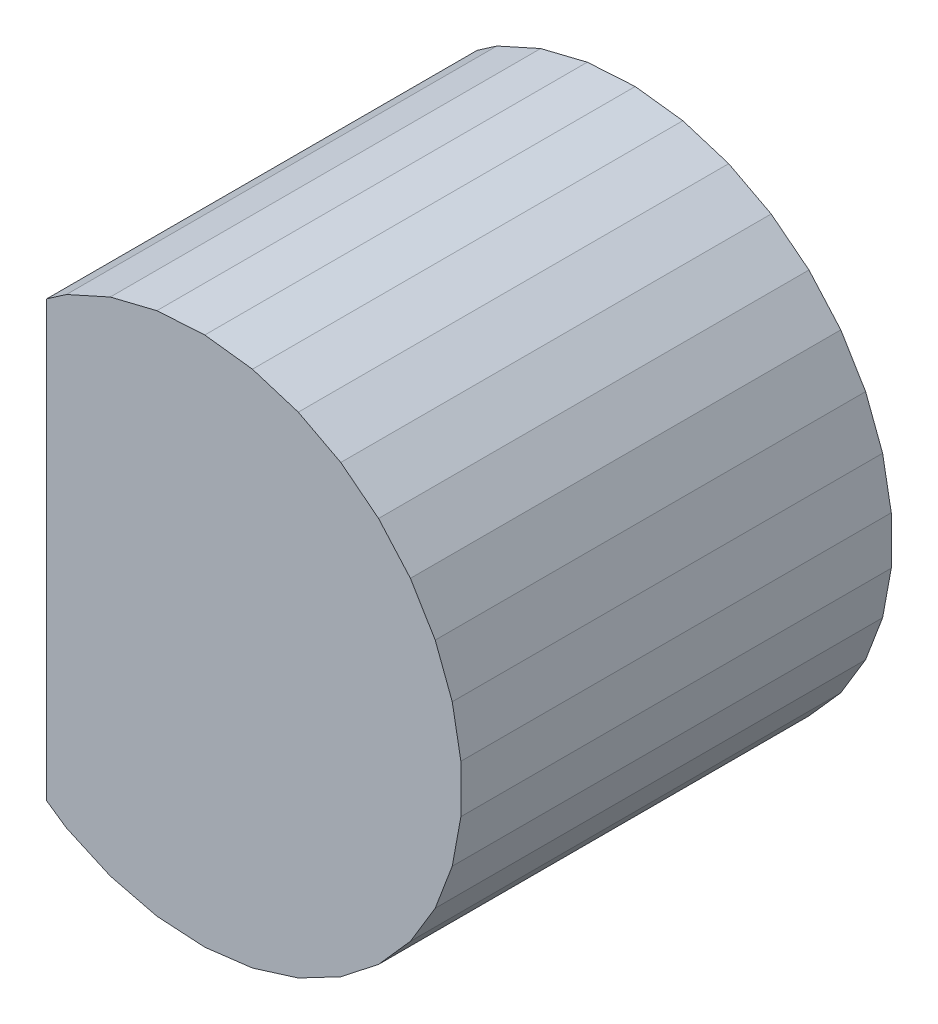
ISO-10303-21;
HEADER;
FILE_DESCRIPTION(('STEP AP214'),'2;1');
FILE_NAME('part.step','',(''),(''),'','','');
FILE_SCHEMA(('AUTOMOTIVE_DESIGN { 1 0 10303 214 1 1 1 1 }'));
ENDSEC;
DATA;
#1=APPLICATION_CONTEXT('core data for automotive mechanical design processes');
#2=APPLICATION_PROTOCOL_DEFINITION('international standard','automotive_design',2000,#1);
#3=PRODUCT_CONTEXT('',#1,'mechanical');
#4=PRODUCT('Part','Part','',(#3));
#5=PRODUCT_RELATED_PRODUCT_CATEGORY('part','',(#4));
#6=PRODUCT_DEFINITION_FORMATION('','',#4);
#7=PRODUCT_DEFINITION_CONTEXT('part definition',#1,'design');
#8=PRODUCT_DEFINITION('design','',#6,#7);
#9=PRODUCT_DEFINITION_SHAPE('','',#8);
#10=(LENGTH_UNIT() NAMED_UNIT(*) SI_UNIT(.MILLI.,.METRE.));
#11=(NAMED_UNIT(*) PLANE_ANGLE_UNIT() SI_UNIT($,.RADIAN.));
#12=(NAMED_UNIT(*) SI_UNIT($,.STERADIAN.) SOLID_ANGLE_UNIT());
#13=UNCERTAINTY_MEASURE_WITH_UNIT(LENGTH_MEASURE(1.E-05),#10,'distance_accuracy_value','');
#14=(GEOMETRIC_REPRESENTATION_CONTEXT(3) GLOBAL_UNCERTAINTY_ASSIGNED_CONTEXT((#13)) GLOBAL_UNIT_ASSIGNED_CONTEXT((#10,
#11,#12)) REPRESENTATION_CONTEXT('',''));
#15=CARTESIAN_POINT('',(0.,0.,0.));
#16=DIRECTION('',(0.,0.,1.));
#17=DIRECTION('',(1.,0.,0.));
#18=AXIS2_PLACEMENT_3D('',#15,#16,#17);
#19=CARTESIAN_POINT('',(-1.84258966,1.93467482,3.82999996));
#20=DIRECTION('',(0.,0.,1.));
#21=DIRECTION('',(1.,0.,0.));
#22=AXIS2_PLACEMENT_3D('',#19,#20,#21);
#23=PLANE('',#22);
#24=DIRECTION('',(0.823090677896412,0.567909971703284,0.));
#25=VECTOR('',#24,1.);
#26=CARTESIAN_POINT('',(-1.84258966,1.93467482,3.82999996));
#27=LINE('',#26,#25);
#28=CARTESIAN_POINT('',(-1.84258966,1.93467482,3.82999996));
#29=VERTEX_POINT('',#28);
#30=CARTESIAN_POINT('',(-1.66679626,2.05596744,3.82999996));
#31=VERTEX_POINT('',#30);
#32=EDGE_CURVE('E291',#29,#31,#27,.T.);
#33=ORIENTED_EDGE('',*,*,#32,.F.);
#34=DIRECTION('',(0.819231920643114,0.57346234418608,0.));
#35=VECTOR('',#34,1.);
#36=CARTESIAN_POINT('',(-1.84264046,1.93463672,3.82999996));
#37=LINE('',#36,#35);
#38=CARTESIAN_POINT('',(-1.84264046,1.93463672,3.82999996));
#39=VERTEX_POINT('',#38);
#40=EDGE_CURVE('E292',#39,#29,#37,.T.);
#41=ORIENTED_EDGE('',*,*,#40,.F.);
#42=DIRECTION('',(0.664363838732906,0.747409318769894,0.));
#43=VECTOR('',#42,1.);
#44=CARTESIAN_POINT('',(-1.84272174,1.93454528,3.82999996));
#45=LINE('',#44,#43);
#46=CARTESIAN_POINT('',(-1.84272174,1.93454528,3.82999996));
#47=VERTEX_POINT('',#46);
#48=EDGE_CURVE('E307',#47,#39,#45,.T.);
#49=ORIENTED_EDGE('',*,*,#48,.F.);
#50=DIRECTION('',(0.471652250398062,0.881784641902116,0.));
#51=VECTOR('',#50,1.);
#52=CARTESIAN_POINT('',(-1.84278016,1.93443606,3.82999996));
#53=LINE('',#52,#51);
#54=CARTESIAN_POINT('',(-1.84278016,1.93443606,3.82999996));
#55=VERTEX_POINT('',#54);
#56=EDGE_CURVE('E634',#55,#47,#53,.T.);
#57=ORIENTED_EDGE('',*,*,#56,.F.);
#58=DIRECTION('',(0.227884467340065,0.973688178805276,0.));
#59=VECTOR('',#58,1.);
#60=CARTESIAN_POINT('',(-1.8428081,1.93431668,3.82999996));
#61=LINE('',#60,#59);
#62=CARTESIAN_POINT('',(-1.8428081,1.93431668,3.82999996));
#63=VERTEX_POINT('',#62);
#64=EDGE_CURVE('E630',#63,#55,#61,.T.);
#65=ORIENTED_EDGE('',*,*,#64,.F.);
#66=DIRECTION('',(0.,1.,0.));
#67=VECTOR('',#66,1.);
#68=CARTESIAN_POINT('',(-1.8428081,-1.93466974,3.82999996));
#69=LINE('',#68,#67);
#70=CARTESIAN_POINT('',(-1.8428081,-1.93466974,3.82999996));
#71=VERTEX_POINT('',#70);
#72=EDGE_CURVE('E626',#71,#63,#69,.T.);
#73=ORIENTED_EDGE('',*,*,#72,.F.);
#74=DIRECTION('',(-1.,0.,0.));
#75=VECTOR('',#74,1.);
#76=CARTESIAN_POINT('',(-1.84258712,-1.93466974,3.82999996));
#77=LINE('',#76,#75);
#78=CARTESIAN_POINT('',(-1.84258712,-1.93466974,3.82999996));
#79=VERTEX_POINT('',#78);
#80=EDGE_CURVE('E622',#79,#71,#77,.T.);
#81=ORIENTED_EDGE('',*,*,#80,.F.);
#82=DIRECTION('',(-0.823090677896412,0.567909971703284,0.));
#83=VECTOR('',#82,1.);
#84=CARTESIAN_POINT('',(-1.66679626,-2.0559649,3.82999996));
#85=LINE('',#84,#83);
#86=CARTESIAN_POINT('',(-1.66679626,-2.0559649,3.82999996));
#87=VERTEX_POINT('',#86);
#88=EDGE_CURVE('E618',#87,#79,#85,.T.);
#89=ORIENTED_EDGE('',*,*,#88,.F.);
#90=DIRECTION('',(-0.911967561990754,0.410262313497889,0.));
#91=VECTOR('',#90,1.);
#92=CARTESIAN_POINT('',(-1.27724662,-2.23120966,3.82999996));
#93=LINE('',#92,#91);
#94=CARTESIAN_POINT('',(-1.27724662,-2.23120966,3.82999996));
#95=VERTEX_POINT('',#94);
#96=EDGE_CURVE('E614',#95,#87,#93,.T.);
#97=ORIENTED_EDGE('',*,*,#96,.F.);
#98=DIRECTION('',(-0.970978241994064,0.239167835576016,0.));
#99=VECTOR('',#98,1.);
#100=CARTESIAN_POINT('',(-0.86249002,-2.333371,3.82999996));
#101=LINE('',#100,#99);
#102=CARTESIAN_POINT('',(-0.86249002,-2.333371,3.82999996));
#103=VERTEX_POINT('',#102);
#104=EDGE_CURVE('E610',#103,#95,#101,.T.);
#105=ORIENTED_EDGE('',*,*,#104,.F.);
#106=DIRECTION('',(-0.998183795511517,0.0602420980562808,0.));
#107=VECTOR('',#106,1.);
#108=CARTESIAN_POINT('',(-0.43611038,-2.35910374,3.82999996));
#109=LINE('',#108,#107);
#110=CARTESIAN_POINT('',(-0.43611038,-2.35910374,3.82999996));
#111=VERTEX_POINT('',#110);
#112=EDGE_CURVE('E606',#111,#103,#109,.T.);
#113=ORIENTED_EDGE('',*,*,#112,.F.);
#114=DIRECTION('',(-0.992694229772383,-0.120657225961047,0.));
#115=VECTOR('',#114,1.);
#116=CARTESIAN_POINT('',(-0.0120777,-2.3075646,3.82999996));
#117=LINE('',#116,#115);
#118=CARTESIAN_POINT('',(-0.0120777,-2.3075646,3.82999996));
#119=VERTEX_POINT('',#118);
#120=EDGE_CURVE('E602',#119,#111,#117,.T.);
#121=ORIENTED_EDGE('',*,*,#120,.F.);
#122=DIRECTION('',(-0.954689978785622,-0.297602157932882,0.));
#123=VECTOR('',#122,1.);
#124=CARTESIAN_POINT('',(0.39572184,-2.18044268,3.82999996));
#125=LINE('',#124,#123);
#126=CARTESIAN_POINT('',(0.39572184,-2.18044268,3.82999996));
#127=VERTEX_POINT('',#126);
#128=EDGE_CURVE('E598',#127,#119,#125,.T.);
#129=ORIENTED_EDGE('',*,*,#128,.F.);
#130=DIRECTION('',(-0.885415094450529,-0.464801151589753,0.));
#131=VECTOR('',#130,1.);
#132=CARTESIAN_POINT('',(0.77393038,-1.98190104,3.82999996));
#133=LINE('',#132,#131);
#134=CARTESIAN_POINT('',(0.77393038,-1.98190104,3.82999996));
#135=VERTEX_POINT('',#134);
#136=EDGE_CURVE('E594',#135,#127,#133,.T.);
#137=ORIENTED_EDGE('',*,*,#136,.F.);
#138=DIRECTION('',(-0.787136200354727,-0.616779216649786,0.));
#139=VECTOR('',#138,1.);
#140=CARTESIAN_POINT('',(1.1101578,-1.71844208,3.82999996));
#141=LINE('',#140,#139);
#142=CARTESIAN_POINT('',(1.1101578,-1.71844208,3.82999996));
#143=VERTEX_POINT('',#142);
#144=EDGE_CURVE('E590',#143,#135,#141,.T.);
#145=ORIENTED_EDGE('',*,*,#144,.F.);
#146=DIRECTION('',(-0.663074755067046,-0.748553183944052,0.));
#147=VECTOR('',#146,1.);
#148=CARTESIAN_POINT('',(1.3933932,-1.39869418,3.82999996));
#149=LINE('',#148,#147);
#150=CARTESIAN_POINT('',(1.3933932,-1.39869418,3.82999996));
#151=VERTEX_POINT('',#150);
#152=EDGE_CURVE('E586',#151,#143,#149,.T.);
#153=ORIENTED_EDGE('',*,*,#152,.F.);
#154=DIRECTION('',(-0.517301766071713,-0.855803063104525,0.));
#155=VECTOR('',#154,1.);
#156=CARTESIAN_POINT('',(1.6143605,-1.03313484,3.82999996));
#157=LINE('',#156,#155);
#158=CARTESIAN_POINT('',(1.6143605,-1.03313484,3.82999996));
#159=VERTEX_POINT('',#158);
#160=EDGE_CURVE('E582',#159,#151,#157,.T.);
#161=ORIENTED_EDGE('',*,*,#160,.F.);
#162=DIRECTION('',(-0.354574822507846,-0.935027644106595,0.));
#163=VECTOR('',#162,1.);
#164=CARTESIAN_POINT('',(1.76581816,-0.63373508,3.82999996));
#165=LINE('',#164,#163);
#166=CARTESIAN_POINT('',(1.76581816,-0.63373508,3.82999996));
#167=VERTEX_POINT('',#166);
#168=EDGE_CURVE('E578',#167,#159,#165,.T.);
#169=ORIENTED_EDGE('',*,*,#168,.F.);
#170=DIRECTION('',(-0.180244738035957,-0.983621794395767,0.));
#171=VECTOR('',#170,1.);
#172=CARTESIAN_POINT('',(1.84281064,-0.2135759,3.82999996));
#173=LINE('',#172,#171);
#174=CARTESIAN_POINT('',(1.84281064,-0.2135759,3.82999996));
#175=VERTEX_POINT('',#174);
#176=EDGE_CURVE('E574',#175,#167,#173,.T.);
#177=ORIENTED_EDGE('',*,*,#176,.F.);
#178=DIRECTION('',(0.,-1.,0.));
#179=VECTOR('',#178,1.);
#180=CARTESIAN_POINT('',(1.84281064,0.21357844,3.82999996));
#181=LINE('',#180,#179);
#182=CARTESIAN_POINT('',(1.84281064,0.21357844,3.82999996));
#183=VERTEX_POINT('',#182);
#184=EDGE_CURVE('E570',#183,#175,#181,.T.);
#185=ORIENTED_EDGE('',*,*,#184,.F.);
#186=DIRECTION('',(0.180244738035957,-0.983621794395767,0.));
#187=VECTOR('',#186,1.);
#188=CARTESIAN_POINT('',(1.76581816,0.63373762,3.82999996));
#189=LINE('',#188,#187);
#190=CARTESIAN_POINT('',(1.76581816,0.63373762,3.82999996));
#191=VERTEX_POINT('',#190);
#192=EDGE_CURVE('E566',#191,#183,#189,.T.);
#193=ORIENTED_EDGE('',*,*,#192,.F.);
#194=DIRECTION('',(0.354574822507846,-0.935027644106595,0.));
#195=VECTOR('',#194,1.);
#196=CARTESIAN_POINT('',(1.6143605,1.03313738,3.82999996));
#197=LINE('',#196,#195);
#198=CARTESIAN_POINT('',(1.6143605,1.03313738,3.82999996));
#199=VERTEX_POINT('',#198);
#200=EDGE_CURVE('E562',#199,#191,#197,.T.);
#201=ORIENTED_EDGE('',*,*,#200,.F.);
#202=DIRECTION('',(0.517301766071713,-0.855803063104525,0.));
#203=VECTOR('',#202,1.);
#204=CARTESIAN_POINT('',(1.3933932,1.39869672,3.82999996));
#205=LINE('',#204,#203);
#206=CARTESIAN_POINT('',(1.3933932,1.39869672,3.82999996));
#207=VERTEX_POINT('',#206);
#208=EDGE_CURVE('E558',#207,#199,#205,.T.);
#209=ORIENTED_EDGE('',*,*,#208,.F.);
#210=DIRECTION('',(0.663074755067046,-0.748553183944052,0.));
#211=VECTOR('',#210,1.);
#212=CARTESIAN_POINT('',(1.1101578,1.71844462,3.82999996));
#213=LINE('',#212,#211);
#214=CARTESIAN_POINT('',(1.1101578,1.71844462,3.82999996));
#215=VERTEX_POINT('',#214);
#216=EDGE_CURVE('E554',#215,#207,#213,.T.);
#217=ORIENTED_EDGE('',*,*,#216,.F.);
#218=DIRECTION('',(0.787136200354727,-0.616779216649786,0.));
#219=VECTOR('',#218,1.);
#220=CARTESIAN_POINT('',(0.77393038,1.98190358,3.82999996));
#221=LINE('',#220,#219);
#222=CARTESIAN_POINT('',(0.77393038,1.98190358,3.82999996));
#223=VERTEX_POINT('',#222);
#224=EDGE_CURVE('E550',#223,#215,#221,.T.);
#225=ORIENTED_EDGE('',*,*,#224,.F.);
#226=DIRECTION('',(0.885415094450529,-0.464801151589753,0.));
#227=VECTOR('',#226,1.);
#228=CARTESIAN_POINT('',(0.39572184,2.18044522,3.82999996));
#229=LINE('',#228,#227);
#230=CARTESIAN_POINT('',(0.39572184,2.18044522,3.82999996));
#231=VERTEX_POINT('',#230);
#232=EDGE_CURVE('E546',#231,#223,#229,.T.);
#233=ORIENTED_EDGE('',*,*,#232,.F.);
#234=DIRECTION('',(0.954689978785622,-0.297602157932882,0.));
#235=VECTOR('',#234,1.);
#236=CARTESIAN_POINT('',(-0.0120777,2.30756714,3.82999996));
#237=LINE('',#236,#235);
#238=CARTESIAN_POINT('',(-0.0120777,2.30756714,3.82999996));
#239=VERTEX_POINT('',#238);
#240=EDGE_CURVE('E542',#239,#231,#237,.T.);
#241=ORIENTED_EDGE('',*,*,#240,.F.);
#242=DIRECTION('',(0.992694229772383,-0.120657225961047,0.));
#243=VECTOR('',#242,1.);
#244=CARTESIAN_POINT('',(-0.43611038,2.35910628,3.82999996));
#245=LINE('',#244,#243);
#246=CARTESIAN_POINT('',(-0.43611038,2.35910628,3.82999996));
#247=VERTEX_POINT('',#246);
#248=EDGE_CURVE('E538',#247,#239,#245,.T.);
#249=ORIENTED_EDGE('',*,*,#248,.F.);
#250=DIRECTION('',(0.998183795511515,0.0602420980563107,0.));
#251=VECTOR('',#250,1.);
#252=CARTESIAN_POINT('',(-0.86249002,2.33337354,3.82999996));
#253=LINE('',#252,#251);
#254=CARTESIAN_POINT('',(-0.86249002,2.33337354,3.82999996));
#255=VERTEX_POINT('',#254);
#256=EDGE_CURVE('E534',#255,#247,#253,.T.);
#257=ORIENTED_EDGE('',*,*,#256,.F.);
#258=DIRECTION('',(0.970978241994064,0.239167835576016,0.));
#259=VECTOR('',#258,1.);
#260=CARTESIAN_POINT('',(-1.27724662,2.2312122,3.82999996));
#261=LINE('',#260,#259);
#262=CARTESIAN_POINT('',(-1.27724662,2.2312122,3.82999996));
#263=VERTEX_POINT('',#262);
#264=EDGE_CURVE('E530',#263,#255,#261,.T.);
#265=ORIENTED_EDGE('',*,*,#264,.F.);
#266=DIRECTION('',(0.911967561990754,0.410262313497889,0.));
#267=VECTOR('',#266,1.);
#268=CARTESIAN_POINT('',(-1.66679626,2.05596744,3.82999996));
#269=LINE('',#268,#267);
#270=EDGE_CURVE('E295',#31,#263,#269,.T.);
#271=ORIENTED_EDGE('',*,*,#270,.F.);
#272=EDGE_LOOP('',(#33,#41,#49,#57,#65,#73,#81,#89,#97,#105,#113,#121,#129,#137,#145,#153,#161,
#169,#177,#185,#193,#201,#209,#217,#225,#233,#241,#249,#257,#265,#271));
#273=FACE_BOUND('',#272,.T.);
#274=ADVANCED_FACE('F17',(#273),#23,.T.);
#275=CARTESIAN_POINT('',(-1.84258966,1.93467482,0.));
#276=DIRECTION('',(0.,0.,1.));
#277=DIRECTION('',(1.,0.,0.));
#278=AXIS2_PLACEMENT_3D('',#275,#276,#277);
#279=PLANE('',#278);
#280=DIRECTION('',(0.823090677896412,0.567909971703284,0.));
#281=VECTOR('',#280,1.);
#282=CARTESIAN_POINT('',(-1.84258966,1.93467482,0.));
#283=LINE('',#282,#281);
#284=CARTESIAN_POINT('',(-1.84258966,1.93467482,0.));
#285=VERTEX_POINT('',#284);
#286=CARTESIAN_POINT('',(-1.66679626,2.05596744,0.));
#287=VERTEX_POINT('',#286);
#288=EDGE_CURVE('E310',#285,#287,#283,.T.);
#289=ORIENTED_EDGE('',*,*,#288,.T.);
#290=DIRECTION('',(0.911967561990754,0.410262313497889,0.));
#291=VECTOR('',#290,1.);
#292=CARTESIAN_POINT('',(-1.66679626,2.05596744,0.));
#293=LINE('',#292,#291);
#294=CARTESIAN_POINT('',(-1.27724662,2.2312122,0.));
#295=VERTEX_POINT('',#294);
#296=EDGE_CURVE('E523',#287,#295,#293,.T.);
#297=ORIENTED_EDGE('',*,*,#296,.T.);
#298=DIRECTION('',(0.970978241994064,0.239167835576016,0.));
#299=VECTOR('',#298,1.);
#300=CARTESIAN_POINT('',(-1.27724662,2.2312122,0.));
#301=LINE('',#300,#299);
#302=CARTESIAN_POINT('',(-0.86249002,2.33337354,0.));
#303=VERTEX_POINT('',#302);
#304=EDGE_CURVE('E520',#295,#303,#301,.T.);
#305=ORIENTED_EDGE('',*,*,#304,.T.);
#306=DIRECTION('',(0.998183795511515,0.0602420980563107,0.));
#307=VECTOR('',#306,1.);
#308=CARTESIAN_POINT('',(-0.86249002,2.33337354,0.));
#309=LINE('',#308,#307);
#310=CARTESIAN_POINT('',(-0.43611038,2.35910628,0.));
#311=VERTEX_POINT('',#310);
#312=EDGE_CURVE('E517',#303,#311,#309,.T.);
#313=ORIENTED_EDGE('',*,*,#312,.T.);
#314=DIRECTION('',(0.992694229772383,-0.120657225961047,0.));
#315=VECTOR('',#314,1.);
#316=CARTESIAN_POINT('',(-0.43611038,2.35910628,0.));
#317=LINE('',#316,#315);
#318=CARTESIAN_POINT('',(-0.0120777,2.30756714,0.));
#319=VERTEX_POINT('',#318);
#320=EDGE_CURVE('E514',#311,#319,#317,.T.);
#321=ORIENTED_EDGE('',*,*,#320,.T.);
#322=DIRECTION('',(0.954689978785622,-0.297602157932882,0.));
#323=VECTOR('',#322,1.);
#324=CARTESIAN_POINT('',(-0.0120777,2.30756714,0.));
#325=LINE('',#324,#323);
#326=CARTESIAN_POINT('',(0.39572184,2.18044522,0.));
#327=VERTEX_POINT('',#326);
#328=EDGE_CURVE('E511',#319,#327,#325,.T.);
#329=ORIENTED_EDGE('',*,*,#328,.T.);
#330=DIRECTION('',(0.885415094450529,-0.464801151589753,0.));
#331=VECTOR('',#330,1.);
#332=CARTESIAN_POINT('',(0.39572184,2.18044522,0.));
#333=LINE('',#332,#331);
#334=CARTESIAN_POINT('',(0.77393038,1.98190358,0.));
#335=VERTEX_POINT('',#334);
#336=EDGE_CURVE('E508',#327,#335,#333,.T.);
#337=ORIENTED_EDGE('',*,*,#336,.T.);
#338=DIRECTION('',(0.787136200354727,-0.616779216649786,0.));
#339=VECTOR('',#338,1.);
#340=CARTESIAN_POINT('',(0.77393038,1.98190358,0.));
#341=LINE('',#340,#339);
#342=CARTESIAN_POINT('',(1.1101578,1.71844462,0.));
#343=VERTEX_POINT('',#342);
#344=EDGE_CURVE('E505',#335,#343,#341,.T.);
#345=ORIENTED_EDGE('',*,*,#344,.T.);
#346=DIRECTION('',(0.663074755067046,-0.748553183944052,0.));
#347=VECTOR('',#346,1.);
#348=CARTESIAN_POINT('',(1.1101578,1.71844462,0.));
#349=LINE('',#348,#347);
#350=CARTESIAN_POINT('',(1.3933932,1.39869672,0.));
#351=VERTEX_POINT('',#350);
#352=EDGE_CURVE('E502',#343,#351,#349,.T.);
#353=ORIENTED_EDGE('',*,*,#352,.T.);
#354=DIRECTION('',(0.517301766071713,-0.855803063104525,0.));
#355=VECTOR('',#354,1.);
#356=CARTESIAN_POINT('',(1.3933932,1.39869672,0.));
#357=LINE('',#356,#355);
#358=CARTESIAN_POINT('',(1.6143605,1.03313738,0.));
#359=VERTEX_POINT('',#358);
#360=EDGE_CURVE('E499',#351,#359,#357,.T.);
#361=ORIENTED_EDGE('',*,*,#360,.T.);
#362=DIRECTION('',(0.354574822507846,-0.935027644106595,0.));
#363=VECTOR('',#362,1.);
#364=CARTESIAN_POINT('',(1.6143605,1.03313738,0.));
#365=LINE('',#364,#363);
#366=CARTESIAN_POINT('',(1.76581816,0.63373762,0.));
#367=VERTEX_POINT('',#366);
#368=EDGE_CURVE('E496',#359,#367,#365,.T.);
#369=ORIENTED_EDGE('',*,*,#368,.T.);
#370=DIRECTION('',(0.180244738035957,-0.983621794395767,0.));
#371=VECTOR('',#370,1.);
#372=CARTESIAN_POINT('',(1.76581816,0.63373762,0.));
#373=LINE('',#372,#371);
#374=CARTESIAN_POINT('',(1.84281064,0.21357844,0.));
#375=VERTEX_POINT('',#374);
#376=EDGE_CURVE('E493',#367,#375,#373,.T.);
#377=ORIENTED_EDGE('',*,*,#376,.T.);
#378=DIRECTION('',(0.,-1.,0.));
#379=VECTOR('',#378,1.);
#380=CARTESIAN_POINT('',(1.84281064,0.21357844,0.));
#381=LINE('',#380,#379);
#382=CARTESIAN_POINT('',(1.84281064,-0.2135759,0.));
#383=VERTEX_POINT('',#382);
#384=EDGE_CURVE('E490',#375,#383,#381,.T.);
#385=ORIENTED_EDGE('',*,*,#384,.T.);
#386=DIRECTION('',(-0.180244738035957,-0.983621794395767,0.));
#387=VECTOR('',#386,1.);
#388=CARTESIAN_POINT('',(1.84281064,-0.2135759,0.));
#389=LINE('',#388,#387);
#390=CARTESIAN_POINT('',(1.76581816,-0.63373508,0.));
#391=VERTEX_POINT('',#390);
#392=EDGE_CURVE('E487',#383,#391,#389,.T.);
#393=ORIENTED_EDGE('',*,*,#392,.T.);
#394=DIRECTION('',(-0.354574822507846,-0.935027644106595,0.));
#395=VECTOR('',#394,1.);
#396=CARTESIAN_POINT('',(1.76581816,-0.63373508,0.));
#397=LINE('',#396,#395);
#398=CARTESIAN_POINT('',(1.6143605,-1.03313484,0.));
#399=VERTEX_POINT('',#398);
#400=EDGE_CURVE('E484',#391,#399,#397,.T.);
#401=ORIENTED_EDGE('',*,*,#400,.T.);
#402=DIRECTION('',(-0.517301766071713,-0.855803063104525,0.));
#403=VECTOR('',#402,1.);
#404=CARTESIAN_POINT('',(1.6143605,-1.03313484,0.));
#405=LINE('',#404,#403);
#406=CARTESIAN_POINT('',(1.3933932,-1.39869418,0.));
#407=VERTEX_POINT('',#406);
#408=EDGE_CURVE('E481',#399,#407,#405,.T.);
#409=ORIENTED_EDGE('',*,*,#408,.T.);
#410=DIRECTION('',(-0.663074755067046,-0.748553183944052,0.));
#411=VECTOR('',#410,1.);
#412=CARTESIAN_POINT('',(1.3933932,-1.39869418,0.));
#413=LINE('',#412,#411);
#414=CARTESIAN_POINT('',(1.1101578,-1.71844208,0.));
#415=VERTEX_POINT('',#414);
#416=EDGE_CURVE('E478',#407,#415,#413,.T.);
#417=ORIENTED_EDGE('',*,*,#416,.T.);
#418=DIRECTION('',(-0.787136200354727,-0.616779216649786,0.));
#419=VECTOR('',#418,1.);
#420=CARTESIAN_POINT('',(1.1101578,-1.71844208,0.));
#421=LINE('',#420,#419);
#422=CARTESIAN_POINT('',(0.77393038,-1.98190104,0.));
#423=VERTEX_POINT('',#422);
#424=EDGE_CURVE('E475',#415,#423,#421,.T.);
#425=ORIENTED_EDGE('',*,*,#424,.T.);
#426=DIRECTION('',(-0.885415094450529,-0.464801151589753,0.));
#427=VECTOR('',#426,1.);
#428=CARTESIAN_POINT('',(0.77393038,-1.98190104,0.));
#429=LINE('',#428,#427);
#430=CARTESIAN_POINT('',(0.39572184,-2.18044268,0.));
#431=VERTEX_POINT('',#430);
#432=EDGE_CURVE('E472',#423,#431,#429,.T.);
#433=ORIENTED_EDGE('',*,*,#432,.T.);
#434=DIRECTION('',(-0.954689978785622,-0.297602157932882,0.));
#435=VECTOR('',#434,1.);
#436=CARTESIAN_POINT('',(0.39572184,-2.18044268,0.));
#437=LINE('',#436,#435);
#438=CARTESIAN_POINT('',(-0.0120777,-2.3075646,0.));
#439=VERTEX_POINT('',#438);
#440=EDGE_CURVE('E469',#431,#439,#437,.T.);
#441=ORIENTED_EDGE('',*,*,#440,.T.);
#442=DIRECTION('',(-0.992694229772383,-0.120657225961047,0.));
#443=VECTOR('',#442,1.);
#444=CARTESIAN_POINT('',(-0.0120777,-2.3075646,0.));
#445=LINE('',#444,#443);
#446=CARTESIAN_POINT('',(-0.43611038,-2.35910374,0.));
#447=VERTEX_POINT('',#446);
#448=EDGE_CURVE('E466',#439,#447,#445,.T.);
#449=ORIENTED_EDGE('',*,*,#448,.T.);
#450=DIRECTION('',(-0.998183795511517,0.0602420980562808,0.));
#451=VECTOR('',#450,1.);
#452=CARTESIAN_POINT('',(-0.43611038,-2.35910374,0.));
#453=LINE('',#452,#451);
#454=CARTESIAN_POINT('',(-0.86249002,-2.333371,0.));
#455=VERTEX_POINT('',#454);
#456=EDGE_CURVE('E463',#447,#455,#453,.T.);
#457=ORIENTED_EDGE('',*,*,#456,.T.);
#458=DIRECTION('',(-0.970978241994064,0.239167835576016,0.));
#459=VECTOR('',#458,1.);
#460=CARTESIAN_POINT('',(-0.86249002,-2.333371,0.));
#461=LINE('',#460,#459);
#462=CARTESIAN_POINT('',(-1.27724662,-2.23120966,0.));
#463=VERTEX_POINT('',#462);
#464=EDGE_CURVE('E460',#455,#463,#461,.T.);
#465=ORIENTED_EDGE('',*,*,#464,.T.);
#466=DIRECTION('',(-0.911967561990754,0.410262313497889,0.));
#467=VECTOR('',#466,1.);
#468=CARTESIAN_POINT('',(-1.27724662,-2.23120966,0.));
#469=LINE('',#468,#467);
#470=CARTESIAN_POINT('',(-1.66679626,-2.0559649,0.));
#471=VERTEX_POINT('',#470);
#472=EDGE_CURVE('E457',#463,#471,#469,.T.);
#473=ORIENTED_EDGE('',*,*,#472,.T.);
#474=DIRECTION('',(-0.823090677896412,0.567909971703284,0.));
#475=VECTOR('',#474,1.);
#476=CARTESIAN_POINT('',(-1.66679626,-2.0559649,0.));
#477=LINE('',#476,#475);
#478=CARTESIAN_POINT('',(-1.84258712,-1.93466974,0.));
#479=VERTEX_POINT('',#478);
#480=EDGE_CURVE('E454',#471,#479,#477,.T.);
#481=ORIENTED_EDGE('',*,*,#480,.T.);
#482=DIRECTION('',(-1.,0.,0.));
#483=VECTOR('',#482,1.);
#484=CARTESIAN_POINT('',(-1.84258712,-1.93466974,0.));
#485=LINE('',#484,#483);
#486=CARTESIAN_POINT('',(-1.8428081,-1.93466974,0.));
#487=VERTEX_POINT('',#486);
#488=EDGE_CURVE('E451',#479,#487,#485,.T.);
#489=ORIENTED_EDGE('',*,*,#488,.T.);
#490=DIRECTION('',(0.,1.,0.));
#491=VECTOR('',#490,1.);
#492=CARTESIAN_POINT('',(-1.8428081,-1.93466974,0.));
#493=LINE('',#492,#491);
#494=CARTESIAN_POINT('',(-1.8428081,1.93431668,0.));
#495=VERTEX_POINT('',#494);
#496=EDGE_CURVE('E448',#487,#495,#493,.T.);
#497=ORIENTED_EDGE('',*,*,#496,.T.);
#498=DIRECTION('',(0.227884467340065,0.973688178805276,0.));
#499=VECTOR('',#498,1.);
#500=CARTESIAN_POINT('',(-1.8428081,1.93431668,0.));
#501=LINE('',#500,#499);
#502=CARTESIAN_POINT('',(-1.84278016,1.93443606,0.));
#503=VERTEX_POINT('',#502);
#504=EDGE_CURVE('E445',#495,#503,#501,.T.);
#505=ORIENTED_EDGE('',*,*,#504,.T.);
#506=DIRECTION('',(0.471652250398062,0.881784641902116,0.));
#507=VECTOR('',#506,1.);
#508=CARTESIAN_POINT('',(-1.84278016,1.93443606,0.));
#509=LINE('',#508,#507);
#510=CARTESIAN_POINT('',(-1.84272174,1.93454528,0.));
#511=VERTEX_POINT('',#510);
#512=EDGE_CURVE('E442',#503,#511,#509,.T.);
#513=ORIENTED_EDGE('',*,*,#512,.T.);
#514=DIRECTION('',(0.664363838732906,0.747409318769894,0.));
#515=VECTOR('',#514,1.);
#516=CARTESIAN_POINT('',(-1.84272174,1.93454528,0.));
#517=LINE('',#516,#515);
#518=CARTESIAN_POINT('',(-1.84264046,1.93463672,0.));
#519=VERTEX_POINT('',#518);
#520=EDGE_CURVE('E439',#511,#519,#517,.T.);
#521=ORIENTED_EDGE('',*,*,#520,.T.);
#522=DIRECTION('',(0.819231920643114,0.57346234418608,0.));
#523=VECTOR('',#522,1.);
#524=CARTESIAN_POINT('',(-1.84264046,1.93463672,0.));
#525=LINE('',#524,#523);
#526=EDGE_CURVE('E436',#519,#285,#525,.T.);
#527=ORIENTED_EDGE('',*,*,#526,.T.);
#528=EDGE_LOOP('',(#289,#297,#305,#313,#321,#329,#337,#345,#353,#361,#369,#377,#385,#393,#401,
#409,#417,#425,#433,#441,#449,#457,#465,#473,#481,#489,#497,#505,#513,#521,#527));
#529=FACE_BOUND('',#528,.T.);
#530=ADVANCED_FACE('F753',(#529),#279,.F.);
#531=CARTESIAN_POINT('',(-1.84264046,1.93463672,0.));
#532=DIRECTION('',(-0.57346234418608,0.819231920643114,0.));
#533=DIRECTION('',(0.,0.,1.));
#534=AXIS2_PLACEMENT_3D('',#531,#532,#533);
#535=PLANE('',#534);
#536=DIRECTION('',(0.,0.,1.));
#537=VECTOR('',#536,1.);
#538=CARTESIAN_POINT('',(-1.84264046,1.93463672,0.));
#539=LINE('',#538,#537);
#540=EDGE_CURVE('E305',#519,#39,#539,.T.);
#541=ORIENTED_EDGE('',*,*,#540,.T.);
#542=ORIENTED_EDGE('',*,*,#40,.T.);
#543=DIRECTION('',(0.,0.,1.));
#544=VECTOR('',#543,1.);
#545=CARTESIAN_POINT('',(-1.84258966,1.93467482,0.));
#546=LINE('',#545,#544);
#547=CARTESIAN_POINT('',(-1.84258966,1.93467482,1.91499998));
#548=VERTEX_POINT('',#547);
#549=EDGE_CURVE('E11',#548,#29,#546,.T.);
#550=ORIENTED_EDGE('',*,*,#549,.F.);
#551=EDGE_CURVE('E21',#285,#548,#546,.T.);
#552=ORIENTED_EDGE('',*,*,#551,.F.);
#553=ORIENTED_EDGE('',*,*,#526,.F.);
#554=EDGE_LOOP('',(#541,#542,#550,#552,#553));
#555=FACE_BOUND('',#554,.T.);
#556=ADVANCED_FACE('F302',(#555),#535,.T.);
#557=CARTESIAN_POINT('',(-1.84272174,1.93454528,0.));
#558=DIRECTION('',(-0.747409318769894,0.664363838732906,0.));
#559=DIRECTION('',(0.,0.,1.));
#560=AXIS2_PLACEMENT_3D('',#557,#558,#559);
#561=PLANE('',#560);
#562=DIRECTION('',(0.,0.,1.));
#563=VECTOR('',#562,1.);
#564=CARTESIAN_POINT('',(-1.84272174,1.93454528,0.));
#565=LINE('',#564,#563);
#566=EDGE_CURVE('E430',#511,#47,#565,.T.);
#567=ORIENTED_EDGE('',*,*,#566,.T.);
#568=ORIENTED_EDGE('',*,*,#48,.T.);
#569=ORIENTED_EDGE('',*,*,#540,.F.);
#570=ORIENTED_EDGE('',*,*,#520,.F.);
#571=EDGE_LOOP('',(#567,#568,#569,#570));
#572=FACE_BOUND('',#571,.T.);
#573=ADVANCED_FACE('F642',(#572),#561,.T.);
#574=CARTESIAN_POINT('',(-1.84278016,1.93443606,0.));
#575=DIRECTION('',(-0.881784641902116,0.471652250398062,0.));
#576=DIRECTION('',(0.,0.,1.));
#577=AXIS2_PLACEMENT_3D('',#574,#575,#576);
#578=PLANE('',#577);
#579=DIRECTION('',(0.,0.,1.));
#580=VECTOR('',#579,1.);
#581=CARTESIAN_POINT('',(-1.84278016,1.93443606,0.));
#582=LINE('',#581,#580);
#583=EDGE_CURVE('E426',#503,#55,#582,.T.);
#584=ORIENTED_EDGE('',*,*,#583,.T.);
#585=ORIENTED_EDGE('',*,*,#56,.T.);
#586=ORIENTED_EDGE('',*,*,#566,.F.);
#587=ORIENTED_EDGE('',*,*,#512,.F.);
#588=EDGE_LOOP('',(#584,#585,#586,#587));
#589=FACE_BOUND('',#588,.T.);
#590=ADVANCED_FACE('F646',(#589),#578,.T.);
#591=CARTESIAN_POINT('',(-1.8428081,1.93431668,0.));
#592=DIRECTION('',(-0.973688178805276,0.227884467340065,0.));
#593=DIRECTION('',(0.,0.,1.));
#594=AXIS2_PLACEMENT_3D('',#591,#592,#593);
#595=PLANE('',#594);
#596=DIRECTION('',(0.,0.,1.));
#597=VECTOR('',#596,1.);
#598=CARTESIAN_POINT('',(-1.8428081,1.93431668,0.));
#599=LINE('',#598,#597);
#600=EDGE_CURVE('E422',#495,#63,#599,.T.);
#601=ORIENTED_EDGE('',*,*,#600,.T.);
#602=ORIENTED_EDGE('',*,*,#64,.T.);
#603=ORIENTED_EDGE('',*,*,#583,.F.);
#604=ORIENTED_EDGE('',*,*,#504,.F.);
#605=EDGE_LOOP('',(#601,#602,#603,#604));
#606=FACE_BOUND('',#605,.T.);
#607=ADVANCED_FACE('F651',(#606),#595,.T.);
#608=CARTESIAN_POINT('',(-1.8428081,-1.93466974,0.));
#609=DIRECTION('',(-1.,0.,0.));
#610=DIRECTION('',(0.,0.,1.));
#611=AXIS2_PLACEMENT_3D('',#608,#609,#610);
#612=PLANE('',#611);
#613=DIRECTION('',(0.,0.,1.));
#614=VECTOR('',#613,1.);
#615=CARTESIAN_POINT('',(-1.8428081,-1.93466974,0.));
#616=LINE('',#615,#614);
#617=EDGE_CURVE('E418',#487,#71,#616,.T.);
#618=ORIENTED_EDGE('',*,*,#617,.T.);
#619=ORIENTED_EDGE('',*,*,#72,.T.);
#620=ORIENTED_EDGE('',*,*,#600,.F.);
#621=ORIENTED_EDGE('',*,*,#496,.F.);
#622=EDGE_LOOP('',(#618,#619,#620,#621));
#623=FACE_BOUND('',#622,.T.);
#624=ADVANCED_FACE('F655',(#623),#612,.T.);
#625=CARTESIAN_POINT('',(-1.84258712,-1.93466974,0.));
#626=DIRECTION('',(0.,-1.,0.));
#627=DIRECTION('',(0.,0.,-1.));
#628=AXIS2_PLACEMENT_3D('',#625,#626,#627);
#629=PLANE('',#628);
#630=DIRECTION('',(0.,0.,1.));
#631=VECTOR('',#630,1.);
#632=CARTESIAN_POINT('',(-1.84258966,-1.93467228,0.));
#633=LINE('',#632,#631);
#634=CARTESIAN_POINT('',(-1.84258712,-1.93466974,1.91499998));
#635=VERTEX_POINT('',#634);
#636=EDGE_CURVE('E39',#479,#635,#633,.T.);
#637=ORIENTED_EDGE('',*,*,#636,.T.);
#638=EDGE_CURVE('E411',#635,#79,#633,.T.);
#639=ORIENTED_EDGE('',*,*,#638,.T.);
#640=ORIENTED_EDGE('',*,*,#80,.T.);
#641=ORIENTED_EDGE('',*,*,#617,.F.);
#642=ORIENTED_EDGE('',*,*,#488,.F.);
#643=EDGE_LOOP('',(#637,#639,#640,#641,#642));
#644=FACE_BOUND('',#643,.T.);
#645=ADVANCED_FACE('F658',(#644),#629,.T.);
#646=CARTESIAN_POINT('',(-1.66679626,-2.0559649,0.));
#647=DIRECTION('',(-0.567909971703284,-0.823090677896412,0.));
#648=DIRECTION('',(-0.823090677896412,0.567909971703284,0.));
#649=AXIS2_PLACEMENT_3D('',#646,#647,#648);
#650=PLANE('',#649);
#651=DIRECTION('',(0.,0.,1.));
#652=VECTOR('',#651,1.);
#653=CARTESIAN_POINT('',(-1.66679626,-2.0559649,0.));
#654=LINE('',#653,#652);
#655=EDGE_CURVE('E414',#471,#87,#654,.T.);
#656=ORIENTED_EDGE('',*,*,#655,.T.);
#657=ORIENTED_EDGE('',*,*,#88,.T.);
#658=ORIENTED_EDGE('',*,*,#638,.F.);
#659=ORIENTED_EDGE('',*,*,#636,.F.);
#660=ORIENTED_EDGE('',*,*,#480,.F.);
#661=EDGE_LOOP('',(#656,#657,#658,#659,#660));
#662=FACE_BOUND('',#661,.T.);
#663=ADVANCED_FACE('F660',(#662),#650,.T.);
#664=CARTESIAN_POINT('',(-1.27724662,-2.23120966,0.));
#665=DIRECTION('',(-0.410262313497889,-0.911967561990754,0.));
#666=DIRECTION('',(-0.911967561990754,0.410262313497889,0.));
#667=AXIS2_PLACEMENT_3D('',#664,#665,#666);
#668=PLANE('',#667);
#669=DIRECTION('',(0.,0.,1.));
#670=VECTOR('',#669,1.);
#671=CARTESIAN_POINT('',(-1.27724662,-2.23120966,0.));
#672=LINE('',#671,#670);
#673=EDGE_CURVE('E407',#463,#95,#672,.T.);
#674=ORIENTED_EDGE('',*,*,#673,.T.);
#675=ORIENTED_EDGE('',*,*,#96,.T.);
#676=ORIENTED_EDGE('',*,*,#655,.F.);
#677=ORIENTED_EDGE('',*,*,#472,.F.);
#678=EDGE_LOOP('',(#674,#675,#676,#677));
#679=FACE_BOUND('',#678,.T.);
#680=ADVANCED_FACE('F665',(#679),#668,.T.);
#681=CARTESIAN_POINT('',(-0.86249002,-2.333371,0.));
#682=DIRECTION('',(-0.239167835576016,-0.970978241994064,0.));
#683=DIRECTION('',(-0.970978241994064,0.239167835576016,0.));
#684=AXIS2_PLACEMENT_3D('',#681,#682,#683);
#685=PLANE('',#684);
#686=DIRECTION('',(0.,0.,1.));
#687=VECTOR('',#686,1.);
#688=CARTESIAN_POINT('',(-0.86249002,-2.333371,0.));
#689=LINE('',#688,#687);
#690=EDGE_CURVE('E403',#455,#103,#689,.T.);
#691=ORIENTED_EDGE('',*,*,#690,.T.);
#692=ORIENTED_EDGE('',*,*,#104,.T.);
#693=ORIENTED_EDGE('',*,*,#673,.F.);
#694=ORIENTED_EDGE('',*,*,#464,.F.);
#695=EDGE_LOOP('',(#691,#692,#693,#694));
#696=FACE_BOUND('',#695,.T.);
#697=ADVANCED_FACE('F668',(#696),#685,.T.);
#698=CARTESIAN_POINT('',(-0.43611038,-2.35910374,0.));
#699=DIRECTION('',(-0.0602420980562808,-0.998183795511517,0.));
#700=DIRECTION('',(-0.998183795511517,0.0602420980562808,0.));
#701=AXIS2_PLACEMENT_3D('',#698,#699,#700);
#702=PLANE('',#701);
#703=DIRECTION('',(0.,0.,1.));
#704=VECTOR('',#703,1.);
#705=CARTESIAN_POINT('',(-0.43611038,-2.35910374,0.));
#706=LINE('',#705,#704);
#707=EDGE_CURVE('E399',#447,#111,#706,.T.);
#708=ORIENTED_EDGE('',*,*,#707,.T.);
#709=ORIENTED_EDGE('',*,*,#112,.T.);
#710=ORIENTED_EDGE('',*,*,#690,.F.);
#711=ORIENTED_EDGE('',*,*,#456,.F.);
#712=EDGE_LOOP('',(#708,#709,#710,#711));
#713=FACE_BOUND('',#712,.T.);
#714=ADVANCED_FACE('F673',(#713),#702,.T.);
#715=CARTESIAN_POINT('',(-0.0120777,-2.3075646,0.));
#716=DIRECTION('',(0.120657225961047,-0.992694229772383,0.));
#717=DIRECTION('',(0.,0.,-1.));
#718=AXIS2_PLACEMENT_3D('',#715,#716,#717);
#719=PLANE('',#718);
#720=DIRECTION('',(0.,0.,1.));
#721=VECTOR('',#720,1.);
#722=CARTESIAN_POINT('',(-0.0120777,-2.3075646,0.));
#723=LINE('',#722,#721);
#724=EDGE_CURVE('E395',#439,#119,#723,.T.);
#725=ORIENTED_EDGE('',*,*,#724,.T.);
#726=ORIENTED_EDGE('',*,*,#120,.T.);
#727=ORIENTED_EDGE('',*,*,#707,.F.);
#728=ORIENTED_EDGE('',*,*,#448,.F.);
#729=EDGE_LOOP('',(#725,#726,#727,#728));
#730=FACE_BOUND('',#729,.T.);
#731=ADVANCED_FACE('F676',(#730),#719,.T.);
#732=CARTESIAN_POINT('',(0.39572184,-2.18044268,0.));
#733=DIRECTION('',(0.297602157932882,-0.954689978785622,0.));
#734=DIRECTION('',(0.,0.,-1.));
#735=AXIS2_PLACEMENT_3D('',#732,#733,#734);
#736=PLANE('',#735);
#737=DIRECTION('',(0.,0.,1.));
#738=VECTOR('',#737,1.);
#739=CARTESIAN_POINT('',(0.39572184,-2.18044268,0.));
#740=LINE('',#739,#738);
#741=EDGE_CURVE('E391',#431,#127,#740,.T.);
#742=ORIENTED_EDGE('',*,*,#741,.T.);
#743=ORIENTED_EDGE('',*,*,#128,.T.);
#744=ORIENTED_EDGE('',*,*,#724,.F.);
#745=ORIENTED_EDGE('',*,*,#440,.F.);
#746=EDGE_LOOP('',(#742,#743,#744,#745));
#747=FACE_BOUND('',#746,.T.);
#748=ADVANCED_FACE('F681',(#747),#736,.T.);
#749=CARTESIAN_POINT('',(0.77393038,-1.98190104,0.));
#750=DIRECTION('',(0.464801151589753,-0.885415094450529,0.));
#751=DIRECTION('',(0.,0.,-1.));
#752=AXIS2_PLACEMENT_3D('',#749,#750,#751);
#753=PLANE('',#752);
#754=DIRECTION('',(0.,0.,1.));
#755=VECTOR('',#754,1.);
#756=CARTESIAN_POINT('',(0.77393038,-1.98190104,0.));
#757=LINE('',#756,#755);
#758=EDGE_CURVE('E387',#423,#135,#757,.T.);
#759=ORIENTED_EDGE('',*,*,#758,.T.);
#760=ORIENTED_EDGE('',*,*,#136,.T.);
#761=ORIENTED_EDGE('',*,*,#741,.F.);
#762=ORIENTED_EDGE('',*,*,#432,.F.);
#763=EDGE_LOOP('',(#759,#760,#761,#762));
#764=FACE_BOUND('',#763,.T.);
#765=ADVANCED_FACE('F684',(#764),#753,.T.);
#766=CARTESIAN_POINT('',(1.1101578,-1.71844208,0.));
#767=DIRECTION('',(0.616779216649786,-0.787136200354727,0.));
#768=DIRECTION('',(0.,0.,-1.));
#769=AXIS2_PLACEMENT_3D('',#766,#767,#768);
#770=PLANE('',#769);
#771=DIRECTION('',(0.,0.,1.));
#772=VECTOR('',#771,1.);
#773=CARTESIAN_POINT('',(1.1101578,-1.71844208,0.));
#774=LINE('',#773,#772);
#775=EDGE_CURVE('E383',#415,#143,#774,.T.);
#776=ORIENTED_EDGE('',*,*,#775,.T.);
#777=ORIENTED_EDGE('',*,*,#144,.T.);
#778=ORIENTED_EDGE('',*,*,#758,.F.);
#779=ORIENTED_EDGE('',*,*,#424,.F.);
#780=EDGE_LOOP('',(#776,#777,#778,#779));
#781=FACE_BOUND('',#780,.T.);
#782=ADVANCED_FACE('F689',(#781),#770,.T.);
#783=CARTESIAN_POINT('',(1.3933932,-1.39869418,0.));
#784=DIRECTION('',(0.748553183944052,-0.663074755067046,0.));
#785=DIRECTION('',(0.,0.,-1.));
#786=AXIS2_PLACEMENT_3D('',#783,#784,#785);
#787=PLANE('',#786);
#788=DIRECTION('',(0.,0.,1.));
#789=VECTOR('',#788,1.);
#790=CARTESIAN_POINT('',(1.3933932,-1.39869418,0.));
#791=LINE('',#790,#789);
#792=EDGE_CURVE('E379',#407,#151,#791,.T.);
#793=ORIENTED_EDGE('',*,*,#792,.T.);
#794=ORIENTED_EDGE('',*,*,#152,.T.);
#795=ORIENTED_EDGE('',*,*,#775,.F.);
#796=ORIENTED_EDGE('',*,*,#416,.F.);
#797=EDGE_LOOP('',(#793,#794,#795,#796));
#798=FACE_BOUND('',#797,.T.);
#799=ADVANCED_FACE('F692',(#798),#787,.T.);
#800=CARTESIAN_POINT('',(1.6143605,-1.03313484,0.));
#801=DIRECTION('',(0.855803063104525,-0.517301766071713,0.));
#802=DIRECTION('',(0.,0.,-1.));
#803=AXIS2_PLACEMENT_3D('',#800,#801,#802);
#804=PLANE('',#803);
#805=DIRECTION('',(0.,0.,1.));
#806=VECTOR('',#805,1.);
#807=CARTESIAN_POINT('',(1.6143605,-1.03313484,0.));
#808=LINE('',#807,#806);
#809=EDGE_CURVE('E375',#399,#159,#808,.T.);
#810=ORIENTED_EDGE('',*,*,#809,.T.);
#811=ORIENTED_EDGE('',*,*,#160,.T.);
#812=ORIENTED_EDGE('',*,*,#792,.F.);
#813=ORIENTED_EDGE('',*,*,#408,.F.);
#814=EDGE_LOOP('',(#810,#811,#812,#813));
#815=FACE_BOUND('',#814,.T.);
#816=ADVANCED_FACE('F697',(#815),#804,.T.);
#817=CARTESIAN_POINT('',(1.76581816,-0.63373508,0.));
#818=DIRECTION('',(0.935027644106595,-0.354574822507846,0.));
#819=DIRECTION('',(0.,0.,-1.));
#820=AXIS2_PLACEMENT_3D('',#817,#818,#819);
#821=PLANE('',#820);
#822=DIRECTION('',(0.,0.,1.));
#823=VECTOR('',#822,1.);
#824=CARTESIAN_POINT('',(1.76581816,-0.63373508,0.));
#825=LINE('',#824,#823);
#826=EDGE_CURVE('E371',#391,#167,#825,.T.);
#827=ORIENTED_EDGE('',*,*,#826,.T.);
#828=ORIENTED_EDGE('',*,*,#168,.T.);
#829=ORIENTED_EDGE('',*,*,#809,.F.);
#830=ORIENTED_EDGE('',*,*,#400,.F.);
#831=EDGE_LOOP('',(#827,#828,#829,#830));
#832=FACE_BOUND('',#831,.T.);
#833=ADVANCED_FACE('F700',(#832),#821,.T.);
#834=CARTESIAN_POINT('',(1.84281064,-0.2135759,0.));
#835=DIRECTION('',(0.983621794395767,-0.180244738035957,0.));
#836=DIRECTION('',(0.,0.,-1.));
#837=AXIS2_PLACEMENT_3D('',#834,#835,#836);
#838=PLANE('',#837);
#839=DIRECTION('',(0.,0.,1.));
#840=VECTOR('',#839,1.);
#841=CARTESIAN_POINT('',(1.84281064,-0.2135759,0.));
#842=LINE('',#841,#840);
#843=EDGE_CURVE('E367',#383,#175,#842,.T.);
#844=ORIENTED_EDGE('',*,*,#843,.T.);
#845=ORIENTED_EDGE('',*,*,#176,.T.);
#846=ORIENTED_EDGE('',*,*,#826,.F.);
#847=ORIENTED_EDGE('',*,*,#392,.F.);
#848=EDGE_LOOP('',(#844,#845,#846,#847));
#849=FACE_BOUND('',#848,.T.);
#850=ADVANCED_FACE('F705',(#849),#838,.T.);
#851=CARTESIAN_POINT('',(1.84281064,0.21357844,0.));
#852=DIRECTION('',(1.,0.,0.));
#853=DIRECTION('',(0.,1.,0.));
#854=AXIS2_PLACEMENT_3D('',#851,#852,#853);
#855=PLANE('',#854);
#856=DIRECTION('',(0.,0.,1.));
#857=VECTOR('',#856,1.);
#858=CARTESIAN_POINT('',(1.84281064,0.21357844,0.));
#859=LINE('',#858,#857);
#860=EDGE_CURVE('E363',#375,#183,#859,.T.);
#861=ORIENTED_EDGE('',*,*,#860,.T.);
#862=ORIENTED_EDGE('',*,*,#184,.T.);
#863=ORIENTED_EDGE('',*,*,#843,.F.);
#864=ORIENTED_EDGE('',*,*,#384,.F.);
#865=EDGE_LOOP('',(#861,#862,#863,#864));
#866=FACE_BOUND('',#865,.T.);
#867=ADVANCED_FACE('F708',(#866),#855,.T.);
#868=CARTESIAN_POINT('',(1.76581816,0.63373762,0.));
#869=DIRECTION('',(0.983621794395767,0.180244738035957,0.));
#870=DIRECTION('',(0.,0.,-1.));
#871=AXIS2_PLACEMENT_3D('',#868,#869,#870);
#872=PLANE('',#871);
#873=DIRECTION('',(0.,0.,1.));
#874=VECTOR('',#873,1.);
#875=CARTESIAN_POINT('',(1.76581816,0.63373762,0.));
#876=LINE('',#875,#874);
#877=EDGE_CURVE('E359',#367,#191,#876,.T.);
#878=ORIENTED_EDGE('',*,*,#877,.T.);
#879=ORIENTED_EDGE('',*,*,#192,.T.);
#880=ORIENTED_EDGE('',*,*,#860,.F.);
#881=ORIENTED_EDGE('',*,*,#376,.F.);
#882=EDGE_LOOP('',(#878,#879,#880,#881));
#883=FACE_BOUND('',#882,.T.);
#884=ADVANCED_FACE('F713',(#883),#872,.T.);
#885=CARTESIAN_POINT('',(1.6143605,1.03313738,0.));
#886=DIRECTION('',(0.935027644106595,0.354574822507846,0.));
#887=DIRECTION('',(0.,0.,-1.));
#888=AXIS2_PLACEMENT_3D('',#885,#886,#887);
#889=PLANE('',#888);
#890=DIRECTION('',(0.,0.,1.));
#891=VECTOR('',#890,1.);
#892=CARTESIAN_POINT('',(1.6143605,1.03313738,0.));
#893=LINE('',#892,#891);
#894=EDGE_CURVE('E355',#359,#199,#893,.T.);
#895=ORIENTED_EDGE('',*,*,#894,.T.);
#896=ORIENTED_EDGE('',*,*,#200,.T.);
#897=ORIENTED_EDGE('',*,*,#877,.F.);
#898=ORIENTED_EDGE('',*,*,#368,.F.);
#899=EDGE_LOOP('',(#895,#896,#897,#898));
#900=FACE_BOUND('',#899,.T.);
#901=ADVANCED_FACE('F716',(#900),#889,.T.);
#902=CARTESIAN_POINT('',(1.3933932,1.39869672,0.));
#903=DIRECTION('',(0.855803063104525,0.517301766071713,0.));
#904=DIRECTION('',(0.,0.,-1.));
#905=AXIS2_PLACEMENT_3D('',#902,#903,#904);
#906=PLANE('',#905);
#907=DIRECTION('',(0.,0.,1.));
#908=VECTOR('',#907,1.);
#909=CARTESIAN_POINT('',(1.3933932,1.39869672,0.));
#910=LINE('',#909,#908);
#911=EDGE_CURVE('E351',#351,#207,#910,.T.);
#912=ORIENTED_EDGE('',*,*,#911,.T.);
#913=ORIENTED_EDGE('',*,*,#208,.T.);
#914=ORIENTED_EDGE('',*,*,#894,.F.);
#915=ORIENTED_EDGE('',*,*,#360,.F.);
#916=EDGE_LOOP('',(#912,#913,#914,#915));
#917=FACE_BOUND('',#916,.T.);
#918=ADVANCED_FACE('F721',(#917),#906,.T.);
#919=CARTESIAN_POINT('',(1.1101578,1.71844462,0.));
#920=DIRECTION('',(0.748553183944052,0.663074755067046,0.));
#921=DIRECTION('',(0.,0.,-1.));
#922=AXIS2_PLACEMENT_3D('',#919,#920,#921);
#923=PLANE('',#922);
#924=DIRECTION('',(0.,0.,1.));
#925=VECTOR('',#924,1.);
#926=CARTESIAN_POINT('',(1.1101578,1.71844462,0.));
#927=LINE('',#926,#925);
#928=EDGE_CURVE('E347',#343,#215,#927,.T.);
#929=ORIENTED_EDGE('',*,*,#928,.T.);
#930=ORIENTED_EDGE('',*,*,#216,.T.);
#931=ORIENTED_EDGE('',*,*,#911,.F.);
#932=ORIENTED_EDGE('',*,*,#352,.F.);
#933=EDGE_LOOP('',(#929,#930,#931,#932));
#934=FACE_BOUND('',#933,.T.);
#935=ADVANCED_FACE('F724',(#934),#923,.T.);
#936=CARTESIAN_POINT('',(0.77393038,1.98190358,0.));
#937=DIRECTION('',(0.616779216649786,0.787136200354727,0.));
#938=DIRECTION('',(0.,0.,-1.));
#939=AXIS2_PLACEMENT_3D('',#936,#937,#938);
#940=PLANE('',#939);
#941=DIRECTION('',(0.,0.,1.));
#942=VECTOR('',#941,1.);
#943=CARTESIAN_POINT('',(0.77393038,1.98190358,0.));
#944=LINE('',#943,#942);
#945=EDGE_CURVE('E343',#335,#223,#944,.T.);
#946=ORIENTED_EDGE('',*,*,#945,.T.);
#947=ORIENTED_EDGE('',*,*,#224,.T.);
#948=ORIENTED_EDGE('',*,*,#928,.F.);
#949=ORIENTED_EDGE('',*,*,#344,.F.);
#950=EDGE_LOOP('',(#946,#947,#948,#949));
#951=FACE_BOUND('',#950,.T.);
#952=ADVANCED_FACE('F729',(#951),#940,.T.);
#953=CARTESIAN_POINT('',(0.39572184,2.18044522,0.));
#954=DIRECTION('',(0.464801151589753,0.885415094450529,0.));
#955=DIRECTION('',(0.,0.,-1.));
#956=AXIS2_PLACEMENT_3D('',#953,#954,#955);
#957=PLANE('',#956);
#958=DIRECTION('',(0.,0.,1.));
#959=VECTOR('',#958,1.);
#960=CARTESIAN_POINT('',(0.39572184,2.18044522,0.));
#961=LINE('',#960,#959);
#962=EDGE_CURVE('E339',#327,#231,#961,.T.);
#963=ORIENTED_EDGE('',*,*,#962,.T.);
#964=ORIENTED_EDGE('',*,*,#232,.T.);
#965=ORIENTED_EDGE('',*,*,#945,.F.);
#966=ORIENTED_EDGE('',*,*,#336,.F.);
#967=EDGE_LOOP('',(#963,#964,#965,#966));
#968=FACE_BOUND('',#967,.T.);
#969=ADVANCED_FACE('F732',(#968),#957,.T.);
#970=CARTESIAN_POINT('',(-0.0120777,2.30756714,0.));
#971=DIRECTION('',(0.297602157932882,0.954689978785622,0.));
#972=DIRECTION('',(0.,0.,-1.));
#973=AXIS2_PLACEMENT_3D('',#970,#971,#972);
#974=PLANE('',#973);
#975=DIRECTION('',(0.,0.,1.));
#976=VECTOR('',#975,1.);
#977=CARTESIAN_POINT('',(-0.0120777,2.30756714,0.));
#978=LINE('',#977,#976);
#979=EDGE_CURVE('E335',#319,#239,#978,.T.);
#980=ORIENTED_EDGE('',*,*,#979,.T.);
#981=ORIENTED_EDGE('',*,*,#240,.T.);
#982=ORIENTED_EDGE('',*,*,#962,.F.);
#983=ORIENTED_EDGE('',*,*,#328,.F.);
#984=EDGE_LOOP('',(#980,#981,#982,#983));
#985=FACE_BOUND('',#984,.T.);
#986=ADVANCED_FACE('F737',(#985),#974,.T.);
#987=CARTESIAN_POINT('',(-0.43611038,2.35910628,0.));
#988=DIRECTION('',(0.120657225961047,0.992694229772383,0.));
#989=DIRECTION('',(0.,0.,-1.));
#990=AXIS2_PLACEMENT_3D('',#987,#988,#989);
#991=PLANE('',#990);
#992=DIRECTION('',(0.,0.,1.));
#993=VECTOR('',#992,1.);
#994=CARTESIAN_POINT('',(-0.43611038,2.35910628,0.));
#995=LINE('',#994,#993);
#996=EDGE_CURVE('E331',#311,#247,#995,.T.);
#997=ORIENTED_EDGE('',*,*,#996,.T.);
#998=ORIENTED_EDGE('',*,*,#248,.T.);
#999=ORIENTED_EDGE('',*,*,#979,.F.);
#1000=ORIENTED_EDGE('',*,*,#320,.F.);
#1001=EDGE_LOOP('',(#997,#998,#999,#1000));
#1002=FACE_BOUND('',#1001,.T.);
#1003=ADVANCED_FACE('F740',(#1002),#991,.T.);
#1004=CARTESIAN_POINT('',(-0.86249002,2.33337354,0.));
#1005=DIRECTION('',(-0.0602420980563107,0.998183795511515,0.));
#1006=DIRECTION('',(0.,0.,1.));
#1007=AXIS2_PLACEMENT_3D('',#1004,#1005,#1006);
#1008=PLANE('',#1007);
#1009=DIRECTION('',(0.,0.,1.));
#1010=VECTOR('',#1009,1.);
#1011=CARTESIAN_POINT('',(-0.86249002,2.33337354,0.));
#1012=LINE('',#1011,#1010);
#1013=EDGE_CURVE('E325',#303,#255,#1012,.T.);
#1014=ORIENTED_EDGE('',*,*,#1013,.T.);
#1015=ORIENTED_EDGE('',*,*,#256,.T.);
#1016=ORIENTED_EDGE('',*,*,#996,.F.);
#1017=ORIENTED_EDGE('',*,*,#312,.F.);
#1018=EDGE_LOOP('',(#1014,#1015,#1016,#1017));
#1019=FACE_BOUND('',#1018,.T.);
#1020=ADVANCED_FACE('F745',(#1019),#1008,.T.);
#1021=CARTESIAN_POINT('',(-1.27724662,2.2312122,0.));
#1022=DIRECTION('',(-0.239167835576016,0.970978241994064,0.));
#1023=DIRECTION('',(0.,0.,1.));
#1024=AXIS2_PLACEMENT_3D('',#1021,#1022,#1023);
#1025=PLANE('',#1024);
#1026=DIRECTION('',(0.,0.,1.));
#1027=VECTOR('',#1026,1.);
#1028=CARTESIAN_POINT('',(-1.27724662,2.2312122,0.));
#1029=LINE('',#1028,#1027);
#1030=EDGE_CURVE('E318',#295,#263,#1029,.T.);
#1031=ORIENTED_EDGE('',*,*,#1030,.T.);
#1032=ORIENTED_EDGE('',*,*,#264,.T.);
#1033=ORIENTED_EDGE('',*,*,#1013,.F.);
#1034=ORIENTED_EDGE('',*,*,#304,.F.);
#1035=EDGE_LOOP('',(#1031,#1032,#1033,#1034));
#1036=FACE_BOUND('',#1035,.T.);
#1037=ADVANCED_FACE('F748',(#1036),#1025,.T.);
#1038=CARTESIAN_POINT('',(-1.66679626,2.05596744,0.));
#1039=DIRECTION('',(-0.410262313497889,0.911967561990754,0.));
#1040=DIRECTION('',(0.,0.,1.));
#1041=AXIS2_PLACEMENT_3D('',#1038,#1039,#1040);
#1042=PLANE('',#1041);
#1043=DIRECTION('',(0.,0.,1.));
#1044=VECTOR('',#1043,1.);
#1045=CARTESIAN_POINT('',(-1.66679626,2.05596744,0.));
#1046=LINE('',#1045,#1044);
#1047=EDGE_CURVE('E313',#287,#31,#1046,.T.);
#1048=ORIENTED_EDGE('',*,*,#1047,.T.);
#1049=ORIENTED_EDGE('',*,*,#270,.T.);
#1050=ORIENTED_EDGE('',*,*,#1030,.F.);
#1051=ORIENTED_EDGE('',*,*,#296,.F.);
#1052=EDGE_LOOP('',(#1048,#1049,#1050,#1051));
#1053=FACE_BOUND('',#1052,.T.);
#1054=ADVANCED_FACE('F751',(#1053),#1042,.T.);
#1055=CARTESIAN_POINT('',(-1.84258966,1.93467482,0.));
#1056=DIRECTION('',(-0.567909971703284,0.823090677896412,0.));
#1057=DIRECTION('',(0.,0.,1.));
#1058=AXIS2_PLACEMENT_3D('',#1055,#1056,#1057);
#1059=PLANE('',#1058);
#1060=ORIENTED_EDGE('',*,*,#551,.T.);
#1061=ORIENTED_EDGE('',*,*,#549,.T.);
#1062=ORIENTED_EDGE('',*,*,#32,.T.);
#1063=ORIENTED_EDGE('',*,*,#1047,.F.);
#1064=ORIENTED_EDGE('',*,*,#288,.F.);
#1065=EDGE_LOOP('',(#1060,#1061,#1062,#1063,#1064));
#1066=FACE_BOUND('',#1065,.T.);
#1067=ADVANCED_FACE('F19',(#1066),#1059,.T.);
#1068=CLOSED_SHELL('',(#274,#530,#556,#573,#590,#607,#624,#645,#663,#680,#697,#714,#731,#748,
#765,#782,#799,#816,#833,#850,#867,#884,#901,#918,#935,#952,#969,#986,#1003,#1020,#1037,#1054,#1067));
#1069=MANIFOLD_SOLID_BREP('B1',#1068);
#1070=ADVANCED_BREP_SHAPE_REPRESENTATION('',(#18,#1069),#14);
#1071=SHAPE_DEFINITION_REPRESENTATION(#9,#1070);
ENDSEC;
END-ISO-10303-21;
